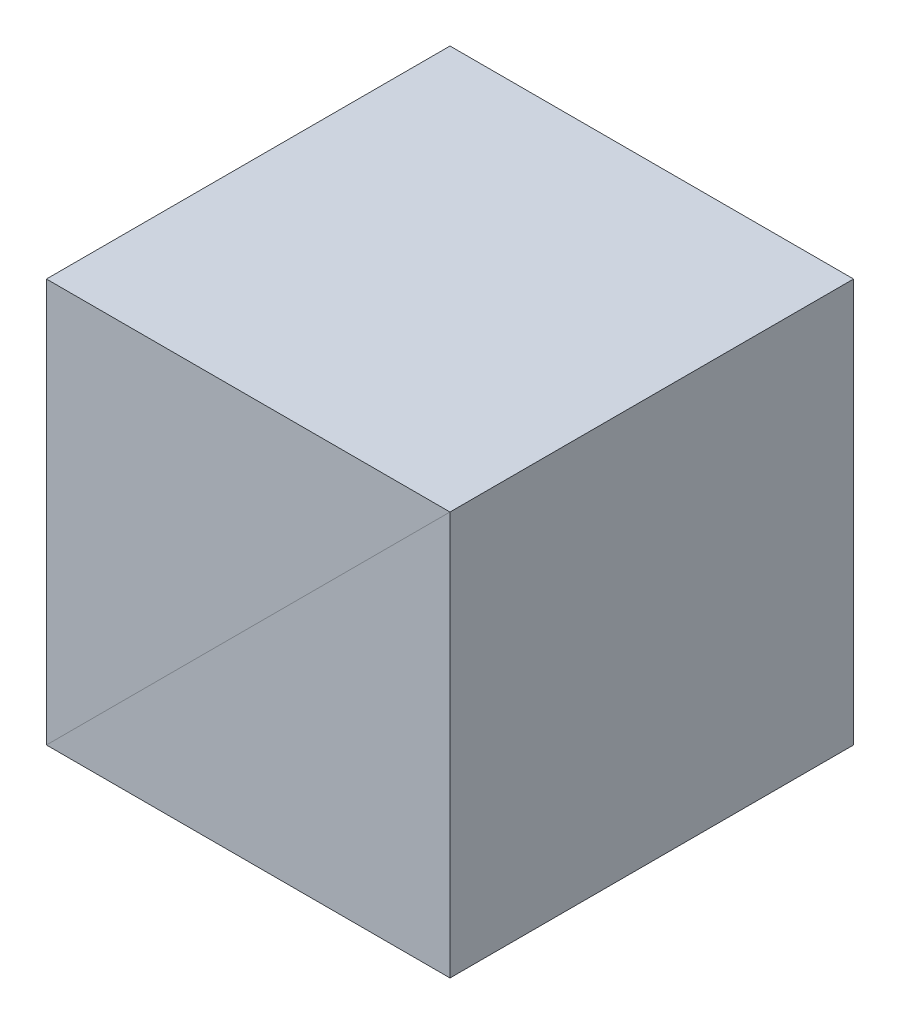
ISO-10303-21;
HEADER;
FILE_DESCRIPTION(('STEP AP214'),'2;1');
FILE_NAME('part.step','',(''),(''),'','','');
FILE_SCHEMA(('AUTOMOTIVE_DESIGN { 1 0 10303 214 1 1 1 1 }'));
ENDSEC;
DATA;
#1=APPLICATION_CONTEXT('core data for automotive mechanical design processes');
#2=APPLICATION_PROTOCOL_DEFINITION('international standard','automotive_design',2000,#1);
#3=PRODUCT_CONTEXT('',#1,'mechanical');
#4=PRODUCT('Part','Part','',(#3));
#5=PRODUCT_RELATED_PRODUCT_CATEGORY('part','',(#4));
#6=PRODUCT_DEFINITION_FORMATION('','',#4);
#7=PRODUCT_DEFINITION_CONTEXT('part definition',#1,'design');
#8=PRODUCT_DEFINITION('design','',#6,#7);
#9=PRODUCT_DEFINITION_SHAPE('','',#8);
#10=(LENGTH_UNIT() NAMED_UNIT(*) SI_UNIT(.MILLI.,.METRE.));
#11=(NAMED_UNIT(*) PLANE_ANGLE_UNIT() SI_UNIT($,.RADIAN.));
#12=(NAMED_UNIT(*) SI_UNIT($,.STERADIAN.) SOLID_ANGLE_UNIT());
#13=UNCERTAINTY_MEASURE_WITH_UNIT(LENGTH_MEASURE(1.E-05),#10,'distance_accuracy_value','');
#14=(GEOMETRIC_REPRESENTATION_CONTEXT(3) GLOBAL_UNCERTAINTY_ASSIGNED_CONTEXT((#13)) GLOBAL_UNIT_ASSIGNED_CONTEXT((#10,
#11,#12)) REPRESENTATION_CONTEXT('',''));
#15=CARTESIAN_POINT('',(0.,0.,0.));
#16=DIRECTION('',(0.,0.,1.));
#17=DIRECTION('',(1.,0.,0.));
#18=AXIS2_PLACEMENT_3D('',#15,#16,#17);
#19=CARTESIAN_POINT('',(7.5,7.5,7.5));
#20=DIRECTION('',(-0.707106781186548,0.707106781186548,0.));
#21=DIRECTION('',(0.707106781186547,0.707106781186547,0.));
#22=AXIS2_PLACEMENT_3D('',#19,#20,#21);
#23=PLANE('',#22);
#24=DIRECTION('',(-0.707106781186547,-0.707106781186547,0.));
#25=VECTOR('',#24,1.);
#26=CARTESIAN_POINT('',(7.5,7.5,-7.5));
#27=LINE('',#26,#25);
#28=CARTESIAN_POINT('',(7.5,7.5,-7.5));
#29=VERTEX_POINT('',#28);
#30=CARTESIAN_POINT('',(-7.5,-7.5,-7.5));
#31=VERTEX_POINT('',#30);
#32=EDGE_CURVE('E101',#29,#31,#27,.T.);
#33=ORIENTED_EDGE('',*,*,#32,.F.);
#34=DIRECTION('',(0.,0.,-1.));
#35=VECTOR('',#34,1.);
#36=CARTESIAN_POINT('',(7.5,7.5,7.5));
#37=LINE('',#36,#35);
#38=CARTESIAN_POINT('',(7.5,7.5,7.5));
#39=VERTEX_POINT('',#38);
#40=EDGE_CURVE('E96',#39,#29,#37,.T.);
#41=ORIENTED_EDGE('',*,*,#40,.F.);
#42=DIRECTION('',(-0.707106781186547,-0.707106781186547,0.));
#43=VECTOR('',#42,1.);
#44=CARTESIAN_POINT('',(7.5,7.5,7.5));
#45=LINE('',#44,#43);
#46=CARTESIAN_POINT('',(-7.5,-7.5,7.5));
#47=VERTEX_POINT('',#46);
#48=EDGE_CURVE('E88',#39,#47,#45,.T.);
#49=ORIENTED_EDGE('',*,*,#48,.T.);
#50=DIRECTION('',(0.,0.,-1.));
#51=VECTOR('',#50,1.);
#52=CARTESIAN_POINT('',(-7.5,-7.5,7.5));
#53=LINE('',#52,#51);
#54=EDGE_CURVE('E12',#47,#31,#53,.T.);
#55=ORIENTED_EDGE('',*,*,#54,.T.);
#56=EDGE_LOOP('',(#33,#41,#49,#55));
#57=FACE_BOUND('',#56,.T.);
#58=ADVANCED_FACE('F49',(#57),#23,.F.);
#59=CARTESIAN_POINT('',(-7.5,-7.5,7.5));
#60=DIRECTION('',(1.,0.,0.));
#61=DIRECTION('',(0.,0.,1.));
#62=AXIS2_PLACEMENT_3D('',#59,#60,#61);
#63=PLANE('',#62);
#64=DIRECTION('',(0.,1.,0.));
#65=VECTOR('',#64,1.);
#66=CARTESIAN_POINT('',(-7.5,-7.5,-7.5));
#67=LINE('',#66,#65);
#68=CARTESIAN_POINT('',(-7.5,7.5,-7.5));
#69=VERTEX_POINT('',#68);
#70=EDGE_CURVE('E93',#31,#69,#67,.T.);
#71=ORIENTED_EDGE('',*,*,#70,.F.);
#72=ORIENTED_EDGE('',*,*,#54,.F.);
#73=DIRECTION('',(0.,1.,0.));
#74=VECTOR('',#73,1.);
#75=CARTESIAN_POINT('',(-7.5,-7.5,7.5));
#76=LINE('',#75,#74);
#77=CARTESIAN_POINT('',(-7.5,7.5,7.5));
#78=VERTEX_POINT('',#77);
#79=EDGE_CURVE('E84',#47,#78,#76,.T.);
#80=ORIENTED_EDGE('',*,*,#79,.T.);
#81=DIRECTION('',(0.,0.,-1.));
#82=VECTOR('',#81,1.);
#83=CARTESIAN_POINT('',(-7.5,7.5,7.5));
#84=LINE('',#83,#82);
#85=EDGE_CURVE('E57',#78,#69,#84,.T.);
#86=ORIENTED_EDGE('',*,*,#85,.T.);
#87=EDGE_LOOP('',(#71,#72,#80,#86));
#88=FACE_BOUND('',#87,.T.);
#89=ADVANCED_FACE('F92',(#88),#63,.F.);
#90=CARTESIAN_POINT('',(7.5,7.5,7.5));
#91=DIRECTION('',(0.,-1.,0.));
#92=DIRECTION('',(-1.,0.,0.));
#93=AXIS2_PLACEMENT_3D('',#90,#91,#92);
#94=PLANE('',#93);
#95=DIRECTION('',(1.,0.,0.));
#96=VECTOR('',#95,1.);
#97=CARTESIAN_POINT('',(7.5,7.5,-7.5));
#98=LINE('',#97,#96);
#99=EDGE_CURVE('E76',#69,#29,#98,.T.);
#100=ORIENTED_EDGE('',*,*,#99,.F.);
#101=ORIENTED_EDGE('',*,*,#85,.F.);
#102=DIRECTION('',(1.,0.,0.));
#103=VECTOR('',#102,1.);
#104=CARTESIAN_POINT('',(7.5,7.5,7.5));
#105=LINE('',#104,#103);
#106=EDGE_CURVE('E65',#78,#39,#105,.T.);
#107=ORIENTED_EDGE('',*,*,#106,.T.);
#108=ORIENTED_EDGE('',*,*,#40,.T.);
#109=EDGE_LOOP('',(#100,#101,#107,#108));
#110=FACE_BOUND('',#109,.T.);
#111=ADVANCED_FACE('F110',(#110),#94,.F.);
#112=CARTESIAN_POINT('',(0.,0.,7.5));
#113=DIRECTION('',(0.,0.,1.));
#114=DIRECTION('',(0.,1.,0.));
#115=AXIS2_PLACEMENT_3D('',#112,#113,#114);
#116=PLANE('',#115);
#117=ORIENTED_EDGE('',*,*,#48,.F.);
#118=ORIENTED_EDGE('',*,*,#106,.F.);
#119=ORIENTED_EDGE('',*,*,#79,.F.);
#120=EDGE_LOOP('',(#117,#118,#119));
#121=FACE_BOUND('',#120,.T.);
#122=ADVANCED_FACE('F86',(#121),#116,.T.);
#123=CARTESIAN_POINT('',(0.,0.,-7.5));
#124=DIRECTION('',(0.,0.,1.));
#125=DIRECTION('',(0.,1.,0.));
#126=AXIS2_PLACEMENT_3D('',#123,#124,#125);
#127=PLANE('',#126);
#128=ORIENTED_EDGE('',*,*,#32,.T.);
#129=ORIENTED_EDGE('',*,*,#70,.T.);
#130=ORIENTED_EDGE('',*,*,#99,.T.);
#131=EDGE_LOOP('',(#128,#129,#130));
#132=FACE_BOUND('',#131,.T.);
#133=ADVANCED_FACE('F104',(#132),#127,.F.);
#134=CLOSED_SHELL('',(#58,#89,#111,#122,#133));
#135=MANIFOLD_SOLID_BREP('B2',#134);
#136=CARTESIAN_POINT('',(7.5,7.5,7.5));
#137=DIRECTION('',(0.707106781186547,-0.707106781186547,0.));
#138=DIRECTION('',(0.707106781186548,0.707106781186548,0.));
#139=AXIS2_PLACEMENT_3D('',#136,#137,#138);
#140=PLANE('',#139);
#141=DIRECTION('',(-0.707106781186547,-0.707106781186547,0.));
#142=VECTOR('',#141,1.);
#143=CARTESIAN_POINT('',(7.5,7.5,-7.5));
#144=LINE('',#143,#142);
#145=CARTESIAN_POINT('',(7.5,7.5,-7.5));
#146=VERTEX_POINT('',#145);
#147=CARTESIAN_POINT('',(-7.5,-7.5,-7.5));
#148=VERTEX_POINT('',#147);
#149=EDGE_CURVE('E197',#146,#148,#144,.T.);
#150=ORIENTED_EDGE('',*,*,#149,.T.);
#151=DIRECTION('',(0.,0.,-1.));
#152=VECTOR('',#151,1.);
#153=CARTESIAN_POINT('',(-7.5,-7.5,7.5));
#154=LINE('',#153,#152);
#155=CARTESIAN_POINT('',(-7.5,-7.5,7.5));
#156=VERTEX_POINT('',#155);
#157=EDGE_CURVE('E47',#156,#148,#154,.T.);
#158=ORIENTED_EDGE('',*,*,#157,.F.);
#159=DIRECTION('',(-0.707106781186547,-0.707106781186547,0.));
#160=VECTOR('',#159,1.);
#161=CARTESIAN_POINT('',(7.5,7.5,7.5));
#162=LINE('',#161,#160);
#163=CARTESIAN_POINT('',(7.5,7.5,7.5));
#164=VERTEX_POINT('',#163);
#165=EDGE_CURVE('E189',#164,#156,#162,.T.);
#166=ORIENTED_EDGE('',*,*,#165,.F.);
#167=DIRECTION('',(0.,0.,-1.));
#168=VECTOR('',#167,1.);
#169=CARTESIAN_POINT('',(7.5,7.5,7.5));
#170=LINE('',#169,#168);
#171=EDGE_CURVE('E198',#164,#146,#170,.T.);
#172=ORIENTED_EDGE('',*,*,#171,.T.);
#173=EDGE_LOOP('',(#150,#158,#166,#172));
#174=FACE_BOUND('',#173,.T.);
#175=ADVANCED_FACE('F147',(#174),#140,.F.);
#176=CARTESIAN_POINT('',(-7.5,-7.5,7.5));
#177=DIRECTION('',(0.,1.,0.));
#178=DIRECTION('',(0.,0.,1.));
#179=AXIS2_PLACEMENT_3D('',#176,#177,#178);
#180=PLANE('',#179);
#181=DIRECTION('',(1.,0.,0.));
#182=VECTOR('',#181,1.);
#183=CARTESIAN_POINT('',(-7.5,-7.5,-7.5));
#184=LINE('',#183,#182);
#185=CARTESIAN_POINT('',(7.5,-7.5,-7.5));
#186=VERTEX_POINT('',#185);
#187=EDGE_CURVE('E176',#148,#186,#184,.T.);
#188=ORIENTED_EDGE('',*,*,#187,.T.);
#189=DIRECTION('',(0.,0.,-1.));
#190=VECTOR('',#189,1.);
#191=CARTESIAN_POINT('',(7.5,-7.5,7.5));
#192=LINE('',#191,#190);
#193=CARTESIAN_POINT('',(7.5,-7.5,7.5));
#194=VERTEX_POINT('',#193);
#195=EDGE_CURVE('E156',#194,#186,#192,.T.);
#196=ORIENTED_EDGE('',*,*,#195,.F.);
#197=DIRECTION('',(1.,0.,0.));
#198=VECTOR('',#197,1.);
#199=CARTESIAN_POINT('',(-7.5,-7.5,7.5));
#200=LINE('',#199,#198);
#201=EDGE_CURVE('E184',#156,#194,#200,.T.);
#202=ORIENTED_EDGE('',*,*,#201,.F.);
#203=ORIENTED_EDGE('',*,*,#157,.T.);
#204=EDGE_LOOP('',(#188,#196,#202,#203));
#205=FACE_BOUND('',#204,.T.);
#206=ADVANCED_FACE('F185',(#205),#180,.F.);
#207=CARTESIAN_POINT('',(7.5,7.5,7.5));
#208=DIRECTION('',(-1.,0.,0.));
#209=DIRECTION('',(0.,-1.,0.));
#210=AXIS2_PLACEMENT_3D('',#207,#208,#209);
#211=PLANE('',#210);
#212=DIRECTION('',(0.,1.,0.));
#213=VECTOR('',#212,1.);
#214=CARTESIAN_POINT('',(7.5,7.5,-7.5));
#215=LINE('',#214,#213);
#216=EDGE_CURVE('E181',#186,#146,#215,.T.);
#217=ORIENTED_EDGE('',*,*,#216,.T.);
#218=ORIENTED_EDGE('',*,*,#171,.F.);
#219=DIRECTION('',(0.,1.,0.));
#220=VECTOR('',#219,1.);
#221=CARTESIAN_POINT('',(7.5,7.5,7.5));
#222=LINE('',#221,#220);
#223=EDGE_CURVE('E164',#194,#164,#222,.T.);
#224=ORIENTED_EDGE('',*,*,#223,.F.);
#225=ORIENTED_EDGE('',*,*,#195,.T.);
#226=EDGE_LOOP('',(#217,#218,#224,#225));
#227=FACE_BOUND('',#226,.T.);
#228=ADVANCED_FACE('F210',(#227),#211,.F.);
#229=CARTESIAN_POINT('',(0.,0.,7.5));
#230=DIRECTION('',(0.,0.,1.));
#231=DIRECTION('',(1.,0.,0.));
#232=AXIS2_PLACEMENT_3D('',#229,#230,#231);
#233=PLANE('',#232);
#234=ORIENTED_EDGE('',*,*,#165,.T.);
#235=ORIENTED_EDGE('',*,*,#201,.T.);
#236=ORIENTED_EDGE('',*,*,#223,.T.);
#237=EDGE_LOOP('',(#234,#235,#236));
#238=FACE_BOUND('',#237,.T.);
#239=ADVANCED_FACE('F192',(#238),#233,.T.);
#240=CARTESIAN_POINT('',(0.,0.,-7.5));
#241=DIRECTION('',(0.,0.,1.));
#242=DIRECTION('',(1.,0.,0.));
#243=AXIS2_PLACEMENT_3D('',#240,#241,#242);
#244=PLANE('',#243);
#245=ORIENTED_EDGE('',*,*,#149,.F.);
#246=ORIENTED_EDGE('',*,*,#216,.F.);
#247=ORIENTED_EDGE('',*,*,#187,.F.);
#248=EDGE_LOOP('',(#245,#246,#247));
#249=FACE_BOUND('',#248,.T.);
#250=ADVANCED_FACE('F211',(#249),#244,.F.);
#251=CLOSED_SHELL('',(#175,#206,#228,#239,#250));
#252=MANIFOLD_SOLID_BREP('B6',#251);
#253=ADVANCED_BREP_SHAPE_REPRESENTATION('',(#18,#135,#252),#14);
#254=SHAPE_DEFINITION_REPRESENTATION(#9,#253);
ENDSEC;
END-ISO-10303-21;
